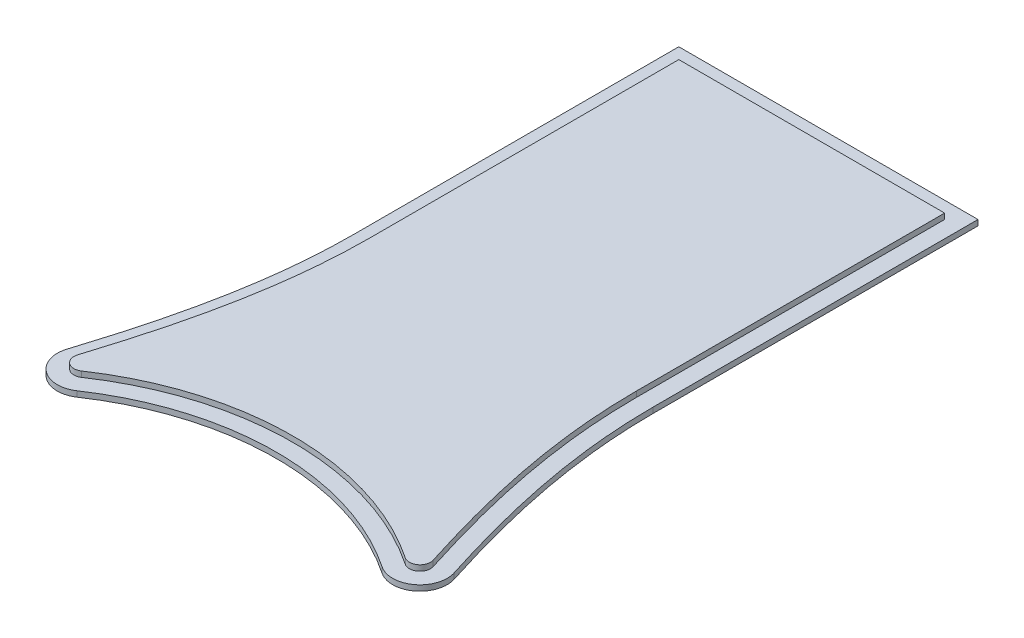
ISO-10303-21;
HEADER;
FILE_DESCRIPTION(('STEP AP214'),'2;1');
FILE_NAME('part.step','',(''),(''),'','','');
FILE_SCHEMA(('AUTOMOTIVE_DESIGN { 1 0 10303 214 1 1 1 1 }'));
ENDSEC;
DATA;
#1=APPLICATION_CONTEXT('core data for automotive mechanical design processes');
#2=APPLICATION_PROTOCOL_DEFINITION('international standard','automotive_design',2000,#1);
#3=PRODUCT_CONTEXT('',#1,'mechanical');
#4=PRODUCT('Part','Part','',(#3));
#5=PRODUCT_RELATED_PRODUCT_CATEGORY('part','',(#4));
#6=PRODUCT_DEFINITION_FORMATION('','',#4);
#7=PRODUCT_DEFINITION_CONTEXT('part definition',#1,'design');
#8=PRODUCT_DEFINITION('design','',#6,#7);
#9=PRODUCT_DEFINITION_SHAPE('','',#8);
#10=(LENGTH_UNIT() NAMED_UNIT(*) SI_UNIT(.MILLI.,.METRE.));
#11=(NAMED_UNIT(*) PLANE_ANGLE_UNIT() SI_UNIT($,.RADIAN.));
#12=(NAMED_UNIT(*) SI_UNIT($,.STERADIAN.) SOLID_ANGLE_UNIT());
#13=UNCERTAINTY_MEASURE_WITH_UNIT(LENGTH_MEASURE(1.E-05),#10,'distance_accuracy_value','');
#14=(GEOMETRIC_REPRESENTATION_CONTEXT(3) GLOBAL_UNCERTAINTY_ASSIGNED_CONTEXT((#13)) GLOBAL_UNIT_ASSIGNED_CONTEXT((#10,
#11,#12)) REPRESENTATION_CONTEXT('',''));
#15=CARTESIAN_POINT('',(0.,0.,0.));
#16=DIRECTION('',(0.,0.,1.));
#17=DIRECTION('',(1.,0.,0.));
#18=AXIS2_PLACEMENT_3D('',#15,#16,#17);
#19=CARTESIAN_POINT('',(61.9771372681462,31.9999999999998,94.6624323351156));
#20=CARTESIAN_POINT('',(60.831885322124,31.9999999999999,91.0366847148333));
#21=CARTESIAN_POINT('',(59.7481486211368,31.9999999999999,87.3929251928582));
#22=CARTESIAN_POINT('',(57.7914261350918,31.9999999999999,80.0436974655204));
#23=CARTESIAN_POINT('',(56.920574580327,31.9999999999999,76.3440377184742));
#24=CARTESIAN_POINT('',(55.4718547297966,31.9999999999999,68.8774072314943));
#25=CARTESIAN_POINT('',(54.8967894478861,31.9999999999999,65.1275738366784));
#26=CARTESIAN_POINT('',(54.1103787804902,31.9999999999999,57.5927727270901));
#27=CARTESIAN_POINT('',(53.8999996958762,31.9999999999998,53.8069725360299));
#28=CARTESIAN_POINT('',(53.8999999999995,31.9999999999998,49.9999997603436));
#29=B_SPLINE_CURVE_WITH_KNOTS('',3,(#19,#20,#21,#22,#23,#24,#25,#26,#27,#28),.UNSPECIFIED.,.F.,
.F.,(4,2,2,2,4),(0.,0.25,0.5,0.75,1.),.UNSPECIFIED.);
#30=DIRECTION('',(0.,-1.,0.));
#31=VECTOR('',#30,1.);
#32=SURFACE_OF_LINEAR_EXTRUSION('',#29,#31);
#33=CARTESIAN_POINT('',(61.9771372681461,30.9999999999998,94.6624323351156));
#34=CARTESIAN_POINT('',(60.8318853221239,30.9999999999999,91.0366847148333));
#35=CARTESIAN_POINT('',(59.7481486211367,30.9999999999999,87.3929251928582));
#36=CARTESIAN_POINT('',(57.7914261350917,30.9999999999999,80.0436974655204));
#37=CARTESIAN_POINT('',(56.9205745803269,30.9999999999999,76.3440377184742));
#38=CARTESIAN_POINT('',(55.4718547297965,30.9999999999999,68.8774072314943));
#39=CARTESIAN_POINT('',(54.8967894478861,30.9999999999999,65.1275738366784));
#40=CARTESIAN_POINT('',(54.1103787804901,30.9999999999999,57.5927727270901));
#41=CARTESIAN_POINT('',(53.8999996958761,30.9999999999998,53.8069725360299));
#42=CARTESIAN_POINT('',(53.8999999999995,30.9999999999998,49.9999997603436));
#43=B_SPLINE_CURVE_WITH_KNOTS('',3,(#33,#34,#35,#36,#37,#38,#39,#40,#41,#42),.UNSPECIFIED.,.F.,
.F.,(4,2,2,2,4),(0.,0.25,0.5,0.75,1.),.UNSPECIFIED.);
#44=CARTESIAN_POINT('',(61.9771372681508,30.9999999999998,94.6624323351142));
#45=VERTEX_POINT('',#44);
#46=CARTESIAN_POINT('',(53.8999999999995,30.9999999999998,49.9999997603436));
#47=VERTEX_POINT('',#46);
#48=EDGE_CURVE('E220',#45,#47,#43,.T.);
#49=ORIENTED_EDGE('',*,*,#48,.T.);
#50=DIRECTION('',(0.,-1.,0.));
#51=VECTOR('',#50,1.);
#52=CARTESIAN_POINT('',(53.8999999999995,31.9999999999998,49.9999997603436));
#53=LINE('',#52,#51);
#54=CARTESIAN_POINT('',(53.8999999999995,31.9999999999998,49.9999997603436));
#55=VERTEX_POINT('',#54);
#56=EDGE_CURVE('E12',#55,#47,#53,.T.);
#57=ORIENTED_EDGE('',*,*,#56,.F.);
#58=CARTESIAN_POINT('',(53.8999999999995,31.9999999999998,49.9999997603436));
#59=CARTESIAN_POINT('',(53.8999996958762,31.9999999999998,53.8069725360299));
#60=CARTESIAN_POINT('',(54.1103787804902,31.9999999999999,57.5927727270901));
#61=CARTESIAN_POINT('',(54.8967894478861,31.9999999999999,65.1275738366784));
#62=CARTESIAN_POINT('',(55.4718547297966,31.9999999999999,68.8774072314943));
#63=CARTESIAN_POINT('',(56.920574580327,31.9999999999999,76.3440377184742));
#64=CARTESIAN_POINT('',(57.7914261350918,31.9999999999999,80.0436974655204));
#65=CARTESIAN_POINT('',(59.7481486211368,31.9999999999999,87.3929251928582));
#66=CARTESIAN_POINT('',(60.831885322124,31.9999999999999,91.0366847148333));
#67=CARTESIAN_POINT('',(61.9771372681462,31.9999999999998,94.6624323351156));
#68=B_SPLINE_CURVE_WITH_KNOTS('',3,(#58,#59,#60,#61,#62,#63,#64,#65,#66,#67),.UNSPECIFIED.,.F.,
.F.,(4,2,2,2,4),(0.,0.25,0.5,0.75,1.),.UNSPECIFIED.);
#69=CARTESIAN_POINT('',(61.9771372681509,31.9999999999998,94.6624323351142));
#70=VERTEX_POINT('',#69);
#71=EDGE_CURVE('E197',#70,#55,#68,.F.);
#72=ORIENTED_EDGE('',*,*,#71,.F.);
#73=DIRECTION('',(0.,-1.,0.));
#74=VECTOR('',#73,1.);
#75=CARTESIAN_POINT('',(61.9771372681509,31.9999999999998,94.6624323351142));
#76=LINE('',#75,#74);
#77=EDGE_CURVE('E144',#70,#45,#76,.T.);
#78=ORIENTED_EDGE('',*,*,#77,.T.);
#79=EDGE_LOOP('',(#49,#57,#72,#78));
#80=FACE_BOUND('',#79,.T.);
#81=ADVANCED_FACE('F47',(#80),#32,.F.);
#82=CARTESIAN_POINT('',(53.8999999999995,31.9999999999998,49.9999997603436));
#83=DIRECTION('',(-1.,0.,0.));
#84=DIRECTION('',(0.,-1.,0.));
#85=AXIS2_PLACEMENT_3D('',#82,#83,#84);
#86=PLANE('',#85);
#87=DIRECTION('',(0.,0.,-1.));
#88=VECTOR('',#87,1.);
#89=CARTESIAN_POINT('',(53.8999999999995,30.9999999999998,49.9999997603436));
#90=LINE('',#89,#88);
#91=CARTESIAN_POINT('',(53.8999999999991,30.9999999999992,-5.39999999999987));
#92=VERTEX_POINT('',#91);
#93=EDGE_CURVE('E155',#47,#92,#90,.T.);
#94=ORIENTED_EDGE('',*,*,#93,.T.);
#95=DIRECTION('',(0.,-1.,0.));
#96=VECTOR('',#95,1.);
#97=CARTESIAN_POINT('',(53.8999999999992,31.9999999999992,-5.39999999999988));
#98=LINE('',#97,#96);
#99=CARTESIAN_POINT('',(53.8999999999992,31.9999999999992,-5.39999999999988));
#100=VERTEX_POINT('',#99);
#101=EDGE_CURVE('E58',#100,#92,#98,.T.);
#102=ORIENTED_EDGE('',*,*,#101,.F.);
#103=DIRECTION('',(0.,0.,-1.));
#104=VECTOR('',#103,1.);
#105=CARTESIAN_POINT('',(53.8999999999995,31.9999999999998,49.9999997603436));
#106=LINE('',#105,#104);
#107=EDGE_CURVE('E110',#55,#100,#106,.T.);
#108=ORIENTED_EDGE('',*,*,#107,.F.);
#109=ORIENTED_EDGE('',*,*,#56,.T.);
#110=EDGE_LOOP('',(#94,#102,#108,#109));
#111=FACE_BOUND('',#110,.T.);
#112=ADVANCED_FACE('F241',(#111),#86,.F.);
#113=CARTESIAN_POINT('',(53.8999999999992,31.9999999999992,-5.39999999999988));
#114=DIRECTION('',(0.,0.,1.));
#115=DIRECTION('',(0.,-1.,0.));
#116=AXIS2_PLACEMENT_3D('',#113,#114,#115);
#117=PLANE('',#116);
#118=DIRECTION('',(-1.,0.,0.));
#119=VECTOR('',#118,1.);
#120=CARTESIAN_POINT('',(53.8999999999991,30.9999999999992,-5.39999999999987));
#121=LINE('',#120,#119);
#122=CARTESIAN_POINT('',(6.09999999999989,31.0000000000019,-5.39999999999992));
#123=VERTEX_POINT('',#122);
#124=EDGE_CURVE('E152',#92,#123,#121,.T.);
#125=ORIENTED_EDGE('',*,*,#124,.T.);
#126=DIRECTION('',(0.,-1.,0.));
#127=VECTOR('',#126,1.);
#128=CARTESIAN_POINT('',(6.09999999999995,32.0000000000019,-5.39999999999993));
#129=LINE('',#128,#127);
#130=CARTESIAN_POINT('',(6.09999999999995,32.0000000000019,-5.39999999999993));
#131=VERTEX_POINT('',#130);
#132=EDGE_CURVE('E158',#131,#123,#129,.T.);
#133=ORIENTED_EDGE('',*,*,#132,.F.);
#134=DIRECTION('',(-1.,0.,0.));
#135=VECTOR('',#134,1.);
#136=CARTESIAN_POINT('',(53.8999999999992,31.9999999999992,-5.39999999999988));
#137=LINE('',#136,#135);
#138=EDGE_CURVE('E212',#100,#131,#137,.T.);
#139=ORIENTED_EDGE('',*,*,#138,.F.);
#140=ORIENTED_EDGE('',*,*,#101,.T.);
#141=EDGE_LOOP('',(#125,#133,#139,#140));
#142=FACE_BOUND('',#141,.T.);
#143=ADVANCED_FACE('F245',(#142),#117,.F.);
#144=CARTESIAN_POINT('',(6.09999999999995,32.0000000000019,-5.39999999999993));
#145=DIRECTION('',(1.,0.,0.));
#146=DIRECTION('',(0.,1.,0.));
#147=AXIS2_PLACEMENT_3D('',#144,#145,#146);
#148=PLANE('',#147);
#149=DIRECTION('',(0.,0.,1.));
#150=VECTOR('',#149,1.);
#151=CARTESIAN_POINT('',(6.09999999999989,31.0000000000019,-5.39999999999992));
#152=LINE('',#151,#150);
#153=CARTESIAN_POINT('',(6.09999999999932,31.0000000000024,50.0000000000008));
#154=VERTEX_POINT('',#153);
#155=EDGE_CURVE('E154',#123,#154,#152,.T.);
#156=ORIENTED_EDGE('',*,*,#155,.T.);
#157=DIRECTION('',(0.,-1.,0.));
#158=VECTOR('',#157,1.);
#159=CARTESIAN_POINT('',(6.09999999999938,32.0000000000024,50.0000000000008));
#160=LINE('',#159,#158);
#161=CARTESIAN_POINT('',(6.09999999999938,32.0000000000024,50.0000000000008));
#162=VERTEX_POINT('',#161);
#163=EDGE_CURVE('E161',#162,#154,#160,.T.);
#164=ORIENTED_EDGE('',*,*,#163,.F.);
#165=DIRECTION('',(0.,0.,1.));
#166=VECTOR('',#165,1.);
#167=CARTESIAN_POINT('',(6.09999999999995,32.0000000000019,-5.39999999999993));
#168=LINE('',#167,#166);
#169=EDGE_CURVE('E291',#131,#162,#168,.T.);
#170=ORIENTED_EDGE('',*,*,#169,.F.);
#171=ORIENTED_EDGE('',*,*,#132,.T.);
#172=EDGE_LOOP('',(#156,#164,#170,#171));
#173=FACE_BOUND('',#172,.T.);
#174=ADVANCED_FACE('F283',(#173),#148,.F.);
#175=CARTESIAN_POINT('',(6.09999999999938,32.0000000000024,50.0000000000008));
#176=CARTESIAN_POINT('',(6.09998811427953,32.0000000000025,53.8013145816372));
#177=CARTESIAN_POINT('',(5.89011158454859,32.0000000000025,57.5912409423099));
#178=CARTESIAN_POINT('',(5.10035899233924,32.0000000000027,65.1510157870064));
#179=CARTESIAN_POINT('',(4.52347776206502,32.0000000000027,68.9045065221967));
#180=CARTESIAN_POINT('',(3.07466457113571,32.0000000000029,76.3647454674164));
#181=CARTESIAN_POINT('',(2.20346017340169,32.000000000003,80.05879522566));
#182=CARTESIAN_POINT('',(0.251705761796023,32.0000000000032,87.3891606749191));
#183=CARTESIAN_POINT('',(-0.829056481060709,32.0000000000033,91.0266930358465));
#184=CARTESIAN_POINT('',(-1.97262684950157,32.0000000000034,94.6476675772352));
#185=B_SPLINE_CURVE_WITH_KNOTS('',3,(#175,#176,#177,#178,#179,#180,#181,#182,#183,#184),
.UNSPECIFIED.,.F.,.F.,(4,2,2,2,4),(0.,0.25,0.5,0.75,1.),.UNSPECIFIED.);
#186=DIRECTION('',(0.,-1.,0.));
#187=VECTOR('',#186,1.);
#188=SURFACE_OF_LINEAR_EXTRUSION('',#185,#187);
#189=CARTESIAN_POINT('',(6.09999999999932,31.0000000000024,50.0000000000008));
#190=CARTESIAN_POINT('',(6.09998811427947,31.0000000000025,53.8013145816372));
#191=CARTESIAN_POINT('',(5.89011158454854,31.0000000000025,57.5912409423099));
#192=CARTESIAN_POINT('',(5.10035899233919,31.0000000000027,65.1510157870064));
#193=CARTESIAN_POINT('',(4.52347776206497,31.0000000000027,68.9045065221967));
#194=CARTESIAN_POINT('',(3.07466457113566,31.0000000000029,76.3647454674164));
#195=CARTESIAN_POINT('',(2.20346017340163,31.000000000003,80.05879522566));
#196=CARTESIAN_POINT('',(0.251705761795968,31.0000000000032,87.3891606749192));
#197=CARTESIAN_POINT('',(-0.829056481060764,31.0000000000033,91.0266930358465));
#198=CARTESIAN_POINT('',(-1.97262684950162,31.0000000000034,94.6476675772352));
#199=B_SPLINE_CURVE_WITH_KNOTS('',3,(#189,#190,#191,#192,#193,#194,#195,#196,#197,#198),
.UNSPECIFIED.,.F.,.F.,(4,2,2,2,4),(0.,0.25,0.5,0.75,1.),.UNSPECIFIED.);
#200=CARTESIAN_POINT('',(-1.97262684950161,31.0000000000034,94.6476675772352));
#201=VERTEX_POINT('',#200);
#202=EDGE_CURVE('E249',#154,#201,#199,.T.);
#203=ORIENTED_EDGE('',*,*,#202,.T.);
#204=DIRECTION('',(0.,-1.,0.));
#205=VECTOR('',#204,1.);
#206=CARTESIAN_POINT('',(-1.97262684950156,32.0000000000034,94.6476675772351));
#207=LINE('',#206,#205);
#208=CARTESIAN_POINT('',(-1.97262684950156,32.0000000000034,94.6476675772351));
#209=VERTEX_POINT('',#208);
#210=EDGE_CURVE('E139',#209,#201,#207,.T.);
#211=ORIENTED_EDGE('',*,*,#210,.F.);
#212=CARTESIAN_POINT('',(-1.97262684950157,32.0000000000034,94.6476675772352));
#213=CARTESIAN_POINT('',(-0.829056481060709,32.0000000000033,91.0266930358465));
#214=CARTESIAN_POINT('',(0.251705761796023,32.0000000000032,87.3891606749191));
#215=CARTESIAN_POINT('',(2.20346017340169,32.000000000003,80.05879522566));
#216=CARTESIAN_POINT('',(3.07466457113571,32.0000000000029,76.3647454674164));
#217=CARTESIAN_POINT('',(4.52347776206502,32.0000000000027,68.9045065221967));
#218=CARTESIAN_POINT('',(5.10035899233924,32.0000000000027,65.1510157870064));
#219=CARTESIAN_POINT('',(5.89011158454859,32.0000000000025,57.5912409423099));
#220=CARTESIAN_POINT('',(6.09998811427953,32.0000000000025,53.8013145816372));
#221=CARTESIAN_POINT('',(6.09999999999938,32.0000000000024,50.0000000000008));
#222=B_SPLINE_CURVE_WITH_KNOTS('',3,(#212,#213,#214,#215,#216,#217,#218,#219,#220,#221),
.UNSPECIFIED.,.F.,.F.,(4,2,2,2,4),(0.,0.25,0.5,0.75,1.),.UNSPECIFIED.);
#223=EDGE_CURVE('E129',#162,#209,#222,.F.);
#224=ORIENTED_EDGE('',*,*,#223,.F.);
#225=ORIENTED_EDGE('',*,*,#163,.T.);
#226=EDGE_LOOP('',(#203,#211,#224,#225));
#227=FACE_BOUND('',#226,.T.);
#228=ADVANCED_FACE('F273',(#227),#188,.F.);
#229=CARTESIAN_POINT('',(-0.156158946894158,32.0000000000033,95.2048429165988));
#230=DIRECTION('',(0.,-1.,0.));
#231=DIRECTION('',(1.,0.,0.));
#232=AXIS2_PLACEMENT_3D('',#229,#230,#231);
#233=CYLINDRICAL_SURFACE('',#232,1.89999999999945);
#234=CARTESIAN_POINT('',(-0.156158946894213,31.0000000000033,95.2048429165988));
#235=DIRECTION('',(0.,1.,0.));
#236=DIRECTION('',(-1.,0.,0.));
#237=AXIS2_PLACEMENT_3D('',#234,#235,#236);
#238=CIRCLE('',#237,1.89999999999945);
#239=CARTESIAN_POINT('',(0.904891086385751,31.0000000000032,96.7809688084217));
#240=VERTEX_POINT('',#239);
#241=EDGE_CURVE('E138',#201,#240,#238,.T.);
#242=ORIENTED_EDGE('',*,*,#241,.T.);
#243=DIRECTION('',(0.,-1.,0.));
#244=VECTOR('',#243,1.);
#245=CARTESIAN_POINT('',(0.904891086385806,32.0000000000032,96.7809688084217));
#246=LINE('',#245,#244);
#247=CARTESIAN_POINT('',(0.904891086385806,32.0000000000032,96.7809688084217));
#248=VERTEX_POINT('',#247);
#249=EDGE_CURVE('E135',#248,#240,#246,.T.);
#250=ORIENTED_EDGE('',*,*,#249,.F.);
#251=CARTESIAN_POINT('',(-0.156158946894158,32.0000000000033,95.2048429165988));
#252=DIRECTION('',(0.,1.,0.));
#253=DIRECTION('',(-1.,0.,0.));
#254=AXIS2_PLACEMENT_3D('',#251,#252,#253);
#255=CIRCLE('',#254,1.89999999999945);
#256=EDGE_CURVE('E123',#209,#248,#255,.T.);
#257=ORIENTED_EDGE('',*,*,#256,.F.);
#258=ORIENTED_EDGE('',*,*,#210,.T.);
#259=EDGE_LOOP('',(#242,#250,#257,#258));
#260=FACE_BOUND('',#259,.T.);
#261=ADVANCED_FACE('F136',(#260),#233,.T.);
#262=CARTESIAN_POINT('',(29.9999999999996,32.0000000000021,140.000000000003));
#263=DIRECTION('',(0.,-1.,0.));
#264=DIRECTION('',(1.,0.,0.));
#265=AXIS2_PLACEMENT_3D('',#262,#263,#264);
#266=CYLINDRICAL_SURFACE('',#265,52.1000001903449);
#267=CARTESIAN_POINT('',(29.9999999999996,31.0000000000021,140.000000000003));
#268=DIRECTION('',(0.,-1.,0.));
#269=DIRECTION('',(-1.,0.,0.));
#270=AXIS2_PLACEMENT_3D('',#267,#268,#269);
#271=CIRCLE('',#270,52.1000001903449);
#272=CARTESIAN_POINT('',(59.0951103761227,31.,96.780969792979));
#273=VERTEX_POINT('',#272);
#274=EDGE_CURVE('E96',#240,#273,#271,.T.);
#275=ORIENTED_EDGE('',*,*,#274,.T.);
#276=DIRECTION('',(0.,-1.,0.));
#277=VECTOR('',#276,1.);
#278=CARTESIAN_POINT('',(59.0951103761228,32.,96.780969792979));
#279=LINE('',#278,#277);
#280=CARTESIAN_POINT('',(59.0951103761228,32.,96.780969792979));
#281=VERTEX_POINT('',#280);
#282=EDGE_CURVE('E140',#281,#273,#279,.T.);
#283=ORIENTED_EDGE('',*,*,#282,.F.);
#284=CARTESIAN_POINT('',(29.9999999999996,32.0000000000021,140.000000000003));
#285=DIRECTION('',(0.,-1.,0.));
#286=DIRECTION('',(-1.,0.,0.));
#287=AXIS2_PLACEMENT_3D('',#284,#285,#286);
#288=CIRCLE('',#287,52.1000001903449);
#289=EDGE_CURVE('E127',#248,#281,#288,.T.);
#290=ORIENTED_EDGE('',*,*,#289,.F.);
#291=ORIENTED_EDGE('',*,*,#249,.T.);
#292=EDGE_LOOP('',(#275,#283,#290,#291));
#293=FACE_BOUND('',#292,.T.);
#294=ADVANCED_FACE('F142',(#293),#266,.F.);
#295=CARTESIAN_POINT('',(60.1561792144309,31.9999999999999,95.2048300628639));
#296=DIRECTION('',(0.,-1.,0.));
#297=DIRECTION('',(1.,0.,0.));
#298=AXIS2_PLACEMENT_3D('',#295,#296,#297);
#299=CYLINDRICAL_SURFACE('',#298,1.90002198105069);
#300=CARTESIAN_POINT('',(60.1561792144308,30.9999999999999,95.2048300628639));
#301=DIRECTION('',(0.,1.,0.));
#302=DIRECTION('',(-1.,0.,0.));
#303=AXIS2_PLACEMENT_3D('',#300,#301,#302);
#304=CIRCLE('',#303,1.90002198105069);
#305=EDGE_CURVE('E102',#273,#45,#304,.T.);
#306=ORIENTED_EDGE('',*,*,#305,.T.);
#307=ORIENTED_EDGE('',*,*,#77,.F.);
#308=CARTESIAN_POINT('',(60.1561792144309,31.9999999999999,95.2048300628639));
#309=DIRECTION('',(0.,1.,0.));
#310=DIRECTION('',(-1.,0.,0.));
#311=AXIS2_PLACEMENT_3D('',#308,#309,#310);
#312=CIRCLE('',#311,1.90002198105069);
#313=EDGE_CURVE('E67',#281,#70,#312,.T.);
#314=ORIENTED_EDGE('',*,*,#313,.F.);
#315=ORIENTED_EDGE('',*,*,#282,.T.);
#316=EDGE_LOOP('',(#306,#307,#314,#315));
#317=FACE_BOUND('',#316,.T.);
#318=ADVANCED_FACE('F178',(#317),#299,.T.);
#319=CARTESIAN_POINT('',(56.1962146550618,31.9999999999999,72.6107224749843));
#320=DIRECTION('',(0.,1.,0.));
#321=DIRECTION('',(0.,0.,1.));
#322=AXIS2_PLACEMENT_3D('',#319,#320,#321);
#323=PLANE('',#322);
#324=ORIENTED_EDGE('',*,*,#71,.T.);
#325=ORIENTED_EDGE('',*,*,#107,.T.);
#326=ORIENTED_EDGE('',*,*,#138,.T.);
#327=ORIENTED_EDGE('',*,*,#169,.T.);
#328=ORIENTED_EDGE('',*,*,#223,.T.);
#329=ORIENTED_EDGE('',*,*,#256,.T.);
#330=ORIENTED_EDGE('',*,*,#289,.T.);
#331=ORIENTED_EDGE('',*,*,#313,.T.);
#332=EDGE_LOOP('',(#324,#325,#326,#327,#328,#329,#330,#331));
#333=FACE_BOUND('',#332,.T.);
#334=ADVANCED_FACE('F125',(#333),#323,.T.);
#335=CARTESIAN_POINT('',(56.1962146550617,30.9999999999999,72.6107224749843));
#336=DIRECTION('',(0.,1.,0.));
#337=DIRECTION('',(0.,0.,1.));
#338=AXIS2_PLACEMENT_3D('',#335,#336,#337);
#339=PLANE('',#338);
#340=ORIENTED_EDGE('',*,*,#48,.F.);
#341=ORIENTED_EDGE('',*,*,#305,.F.);
#342=ORIENTED_EDGE('',*,*,#274,.F.);
#343=ORIENTED_EDGE('',*,*,#241,.F.);
#344=ORIENTED_EDGE('',*,*,#202,.F.);
#345=ORIENTED_EDGE('',*,*,#155,.F.);
#346=ORIENTED_EDGE('',*,*,#124,.F.);
#347=ORIENTED_EDGE('',*,*,#93,.F.);
#348=EDGE_LOOP('',(#340,#341,#342,#343,#344,#345,#346,#347));
#349=FACE_BOUND('',#348,.T.);
#350=ADVANCED_FACE('F177',(#349),#339,.F.);
#351=CLOSED_SHELL('',(#81,#112,#143,#174,#228,#261,#294,#318,#334,#350));
#352=MANIFOLD_SOLID_BREP('B2',#351);
#353=CARTESIAN_POINT('',(64.8435120037774,30.9999999999996,93.7768501131982));
#354=CARTESIAN_POINT('',(63.7206320543695,30.9999999999997,90.2226257238345));
#355=CARTESIAN_POINT('',(62.6572562644365,30.9999999999997,86.6509505777958));
#356=CARTESIAN_POINT('',(60.7351396973803,30.9999999999997,79.4475870724027));
#357=CARTESIAN_POINT('',(59.8785533415817,30.9999999999997,75.8215608178004));
#358=CARTESIAN_POINT('',(58.4518938892415,30.9999999999998,68.5031505998741));
#359=CARTESIAN_POINT('',(57.884751670229,30.9999999999998,64.8283861320974));
#360=CARTESIAN_POINT('',(57.1082288820461,30.9999999999998,57.4431158329596));
#361=CARTESIAN_POINT('',(56.8999997018529,30.9999999999998,53.7321555537256));
#362=CARTESIAN_POINT('',(56.8999999999994,30.9999999999998,50.0000000000012));
#363=B_SPLINE_CURVE_WITH_KNOTS('',3,(#353,#354,#355,#356,#357,#358,#359,#360,#361,#362),
.UNSPECIFIED.,.F.,.F.,(4,2,2,2,4),(0.,0.25,0.5,0.75,1.),.UNSPECIFIED.);
#364=DIRECTION('',(0.,-1.,0.));
#365=VECTOR('',#364,1.);
#366=SURFACE_OF_LINEAR_EXTRUSION('',#363,#365);
#367=CARTESIAN_POINT('',(64.8435120037774,29.9999999999996,93.7768501131982));
#368=CARTESIAN_POINT('',(63.7206320543695,29.9999999999997,90.2226257238345));
#369=CARTESIAN_POINT('',(62.6572562644365,29.9999999999997,86.6509505777958));
#370=CARTESIAN_POINT('',(60.7351396973803,29.9999999999997,79.4475870724027));
#371=CARTESIAN_POINT('',(59.8785533415817,29.9999999999997,75.8215608178004));
#372=CARTESIAN_POINT('',(58.4518938892415,29.9999999999998,68.5031505998741));
#373=CARTESIAN_POINT('',(57.884751670229,29.9999999999998,64.8283861320974));
#374=CARTESIAN_POINT('',(57.1082288820461,29.9999999999998,57.4431158329596));
#375=CARTESIAN_POINT('',(56.8999997018529,29.9999999999998,53.7321555537256));
#376=CARTESIAN_POINT('',(56.8999999999994,29.9999999999998,50.0000000000012));
#377=B_SPLINE_CURVE_WITH_KNOTS('',3,(#367,#368,#369,#370,#371,#372,#373,#374,#375,#376),
.UNSPECIFIED.,.F.,.F.,(4,2,2,2,4),(0.,0.25,0.5,0.75,1.),.UNSPECIFIED.);
#378=CARTESIAN_POINT('',(64.8435120037774,29.9999999999996,93.7768501131982));
#379=VERTEX_POINT('',#378);
#380=CARTESIAN_POINT('',(56.8999999999994,29.9999999999998,50.0000000000012));
#381=VERTEX_POINT('',#380);
#382=EDGE_CURVE('E654',#379,#381,#377,.T.);
#383=ORIENTED_EDGE('',*,*,#382,.T.);
#384=DIRECTION('',(0.,-1.,0.));
#385=VECTOR('',#384,1.);
#386=CARTESIAN_POINT('',(56.8999999999994,30.9999999999998,50.0000000000012));
#387=LINE('',#386,#385);
#388=CARTESIAN_POINT('',(56.8999999999994,30.9999999999998,50.0000000000012));
#389=VERTEX_POINT('',#388);
#390=EDGE_CURVE('E45',#389,#381,#387,.T.);
#391=ORIENTED_EDGE('',*,*,#390,.F.);
#392=CARTESIAN_POINT('',(56.8999999999994,30.9999999999998,50.0000000000012));
#393=CARTESIAN_POINT('',(56.8999997018529,30.9999999999998,53.7321555537256));
#394=CARTESIAN_POINT('',(57.1082288820461,30.9999999999998,57.4431158329596));
#395=CARTESIAN_POINT('',(57.884751670229,30.9999999999998,64.8283861320974));
#396=CARTESIAN_POINT('',(58.4518938892415,30.9999999999998,68.5031505998741));
#397=CARTESIAN_POINT('',(59.8785533415817,30.9999999999997,75.8215608178004));
#398=CARTESIAN_POINT('',(60.7351396973803,30.9999999999997,79.4475870724027));
#399=CARTESIAN_POINT('',(62.6572562644365,30.9999999999997,86.6509505777958));
#400=CARTESIAN_POINT('',(63.7206320543695,30.9999999999997,90.2226257238345));
#401=CARTESIAN_POINT('',(64.8435120037774,30.9999999999996,93.7768501131982));
#402=B_SPLINE_CURVE_WITH_KNOTS('',3,(#392,#393,#394,#395,#396,#397,#398,#399,#400,#401),
.UNSPECIFIED.,.F.,.F.,(4,2,2,2,4),(0.,0.25,0.5,0.75,1.),.UNSPECIFIED.);
#403=CARTESIAN_POINT('',(64.8435120037774,30.9999999999996,93.7768501131982));
#404=VERTEX_POINT('',#403);
#405=EDGE_CURVE('E626',#404,#389,#402,.F.);
#406=ORIENTED_EDGE('',*,*,#405,.F.);
#407=DIRECTION('',(0.,-1.,0.));
#408=VECTOR('',#407,1.);
#409=CARTESIAN_POINT('',(64.8435120037774,30.9999999999996,93.7768501131982));
#410=LINE('',#409,#408);
#411=EDGE_CURVE('E488',#404,#379,#410,.T.);
#412=ORIENTED_EDGE('',*,*,#411,.T.);
#413=EDGE_LOOP('',(#383,#391,#406,#412));
#414=FACE_BOUND('',#413,.T.);
#415=ADVANCED_FACE('F389',(#414),#366,.F.);
#416=CARTESIAN_POINT('',(56.8999999999994,30.9999999999998,50.0000000000012));
#417=DIRECTION('',(-1.,0.,0.));
#418=DIRECTION('',(0.,-1.,0.));
#419=AXIS2_PLACEMENT_3D('',#416,#417,#418);
#420=PLANE('',#419);
#421=DIRECTION('',(0.,0.,-1.));
#422=VECTOR('',#421,1.);
#423=CARTESIAN_POINT('',(56.8999999999994,29.9999999999998,50.0000000000012));
#424=LINE('',#423,#422);
#425=CARTESIAN_POINT('',(56.8999999999991,29.9999999999999,-8.39999999999987));
#426=VERTEX_POINT('',#425);
#427=EDGE_CURVE('E546',#381,#426,#424,.T.);
#428=ORIENTED_EDGE('',*,*,#427,.T.);
#429=DIRECTION('',(0.,-1.,0.));
#430=VECTOR('',#429,1.);
#431=CARTESIAN_POINT('',(56.8999999999991,30.9999999999999,-8.39999999999987));
#432=LINE('',#431,#430);
#433=CARTESIAN_POINT('',(56.8999999999991,30.9999999999999,-8.39999999999987));
#434=VERTEX_POINT('',#433);
#435=EDGE_CURVE('E400',#434,#426,#432,.T.);
#436=ORIENTED_EDGE('',*,*,#435,.F.);
#437=DIRECTION('',(0.,0.,-1.));
#438=VECTOR('',#437,1.);
#439=CARTESIAN_POINT('',(56.8999999999994,30.9999999999998,50.0000000000012));
#440=LINE('',#439,#438);
#441=EDGE_CURVE('E454',#389,#434,#440,.T.);
#442=ORIENTED_EDGE('',*,*,#441,.F.);
#443=ORIENTED_EDGE('',*,*,#390,.T.);
#444=EDGE_LOOP('',(#428,#436,#442,#443));
#445=FACE_BOUND('',#444,.T.);
#446=ADVANCED_FACE('F671',(#445),#420,.F.);
#447=CARTESIAN_POINT('',(56.8999999999991,30.9999999999999,-8.39999999999987));
#448=DIRECTION('',(0.,0.,1.));
#449=DIRECTION('',(1.,0.,0.));
#450=AXIS2_PLACEMENT_3D('',#447,#448,#449);
#451=PLANE('',#450);
#452=DIRECTION('',(-1.,0.,0.));
#453=VECTOR('',#452,1.);
#454=CARTESIAN_POINT('',(56.8999999999991,29.9999999999999,-8.39999999999987));
#455=LINE('',#454,#453);
#456=CARTESIAN_POINT('',(3.09999999999991,30.0000000000008,-8.39999999999993));
#457=VERTEX_POINT('',#456);
#458=EDGE_CURVE('E541',#426,#457,#455,.T.);
#459=ORIENTED_EDGE('',*,*,#458,.T.);
#460=DIRECTION('',(0.,-1.,0.));
#461=VECTOR('',#460,1.);
#462=CARTESIAN_POINT('',(3.09999999999992,31.0000000000008,-8.39999999999993));
#463=LINE('',#462,#461);
#464=CARTESIAN_POINT('',(3.09999999999992,31.0000000000008,-8.39999999999993));
#465=VERTEX_POINT('',#464);
#466=EDGE_CURVE('E548',#465,#457,#463,.T.);
#467=ORIENTED_EDGE('',*,*,#466,.F.);
#468=DIRECTION('',(-1.,0.,0.));
#469=VECTOR('',#468,1.);
#470=CARTESIAN_POINT('',(56.8999999999991,30.9999999999999,-8.39999999999987));
#471=LINE('',#470,#469);
#472=EDGE_CURVE('E540',#434,#465,#471,.T.);
#473=ORIENTED_EDGE('',*,*,#472,.F.);
#474=ORIENTED_EDGE('',*,*,#435,.T.);
#475=EDGE_LOOP('',(#459,#467,#473,#474));
#476=FACE_BOUND('',#475,.T.);
#477=ADVANCED_FACE('F675',(#476),#451,.F.);
#478=CARTESIAN_POINT('',(3.09999999999992,31.0000000000008,-8.39999999999993));
#479=DIRECTION('',(1.,0.,0.));
#480=DIRECTION('',(0.,1.,0.));
#481=AXIS2_PLACEMENT_3D('',#478,#479,#480);
#482=PLANE('',#481);
#483=DIRECTION('',(0.,0.,1.));
#484=VECTOR('',#483,1.);
#485=CARTESIAN_POINT('',(3.09999999999991,30.0000000000008,-8.39999999999993));
#486=LINE('',#485,#484);
#487=CARTESIAN_POINT('',(3.09999999999927,30.0000000000007,50.0000000000007));
#488=VERTEX_POINT('',#487);
#489=EDGE_CURVE('E545',#457,#488,#486,.T.);
#490=ORIENTED_EDGE('',*,*,#489,.T.);
#491=DIRECTION('',(0.,-1.,0.));
#492=VECTOR('',#491,1.);
#493=CARTESIAN_POINT('',(3.09999999999929,31.0000000000007,50.0000000000007));
#494=LINE('',#493,#492);
#495=CARTESIAN_POINT('',(3.09999999999929,31.0000000000007,50.0000000000007));
#496=VERTEX_POINT('',#495);
#497=EDGE_CURVE('E551',#496,#488,#494,.T.);
#498=ORIENTED_EDGE('',*,*,#497,.F.);
#499=DIRECTION('',(0.,0.,1.));
#500=VECTOR('',#499,1.);
#501=CARTESIAN_POINT('',(3.09999999999992,31.0000000000008,-8.39999999999993));
#502=LINE('',#501,#500);
#503=EDGE_CURVE('E580',#465,#496,#502,.T.);
#504=ORIENTED_EDGE('',*,*,#503,.F.);
#505=ORIENTED_EDGE('',*,*,#466,.T.);
#506=EDGE_LOOP('',(#490,#498,#504,#505));
#507=FACE_BOUND('',#506,.T.);
#508=ADVANCED_FACE('F530',(#507),#482,.F.);
#509=CARTESIAN_POINT('',(3.09999999999929,31.0000000000007,50.0000000000007));
#510=CARTESIAN_POINT('',(3.09999679841227,31.0000000000007,53.72685721013));
#511=CARTESIAN_POINT('',(2.89224059660364,31.0000000000007,57.4424050538926));
#512=CARTESIAN_POINT('',(2.11217408299241,31.0000000000007,64.8536556562152));
#513=CARTESIAN_POINT('',(1.54302367032464,31.0000000000007,68.5328945533186));
#514=CARTESIAN_POINT('',(-0.597610279008472,31.0000000000007,79.5024282814441));
#515=CARTESIAN_POINT('',(-2.59792193549164,31.0000000000008,86.6681283225209));
#516=CARTESIAN_POINT('',(-4.84073406414571,31.0000000000008,93.7679170413976));
#517=B_SPLINE_CURVE_WITH_KNOTS('',3,(#509,#510,#511,#512,#513,#514,#515,#516),.UNSPECIFIED.,.F.,
.F.,(4,2,2,4),(0.,0.25,0.5,1.),.UNSPECIFIED.);
#518=DIRECTION('',(0.,-1.,0.));
#519=VECTOR('',#518,1.);
#520=SURFACE_OF_LINEAR_EXTRUSION('',#517,#519);
#521=CARTESIAN_POINT('',(3.09999999999927,30.0000000000007,50.0000000000007));
#522=CARTESIAN_POINT('',(3.09999679841226,30.0000000000007,53.72685721013));
#523=CARTESIAN_POINT('',(2.89224059660362,30.0000000000007,57.4424050538926));
#524=CARTESIAN_POINT('',(2.11217408299239,30.0000000000007,64.8536556562152));
#525=CARTESIAN_POINT('',(1.54302367032462,30.0000000000007,68.5328945533186));
#526=CARTESIAN_POINT('',(-0.597610279008489,30.0000000000007,79.5024282814441));
#527=CARTESIAN_POINT('',(-2.59792193549165,30.0000000000008,86.6681283225209));
#528=CARTESIAN_POINT('',(-4.84073406414573,30.0000000000008,93.7679170413976));
#529=B_SPLINE_CURVE_WITH_KNOTS('',3,(#521,#522,#523,#524,#525,#526,#527,#528),.UNSPECIFIED.,.F.,
.F.,(4,2,2,4),(0.,0.25,0.5,1.),.UNSPECIFIED.);
#530=CARTESIAN_POINT('',(-4.84073406414573,30.0000000000008,93.7679170413976));
#531=VERTEX_POINT('',#530);
#532=EDGE_CURVE('E599',#488,#531,#529,.T.);
#533=ORIENTED_EDGE('',*,*,#532,.T.);
#534=DIRECTION('',(0.,-1.,0.));
#535=VECTOR('',#534,1.);
#536=CARTESIAN_POINT('',(-4.84073406414571,31.0000000000008,93.7679170413976));
#537=LINE('',#536,#535);
#538=CARTESIAN_POINT('',(-4.84073406414571,31.0000000000008,93.7679170413976));
#539=VERTEX_POINT('',#538);
#540=EDGE_CURVE('E483',#539,#531,#537,.T.);
#541=ORIENTED_EDGE('',*,*,#540,.F.);
#542=CARTESIAN_POINT('',(-4.84073406414571,31.0000000000008,93.7679170413976));
#543=CARTESIAN_POINT('',(-2.59792193549164,31.0000000000008,86.6681283225209));
#544=CARTESIAN_POINT('',(-0.597610279008472,31.0000000000007,79.5024282814441));
#545=CARTESIAN_POINT('',(1.54302367032464,31.0000000000007,68.5328945533186));
#546=CARTESIAN_POINT('',(2.11217408299241,31.0000000000007,64.8536556562152));
#547=CARTESIAN_POINT('',(2.89224059660364,31.0000000000007,57.4424050538926));
#548=CARTESIAN_POINT('',(3.09999679841227,31.0000000000007,53.72685721013));
#549=CARTESIAN_POINT('',(3.09999999999929,31.0000000000007,50.0000000000007));
#550=B_SPLINE_CURVE_WITH_KNOTS('',3,(#542,#543,#544,#545,#546,#547,#548,#549),.UNSPECIFIED.,.F.,
.F.,(4,2,2,4),(0.,0.5,0.75,1.),.UNSPECIFIED.);
#551=EDGE_CURVE('E473',#496,#539,#550,.F.);
#552=ORIENTED_EDGE('',*,*,#551,.F.);
#553=ORIENTED_EDGE('',*,*,#497,.T.);
#554=EDGE_LOOP('',(#533,#541,#552,#553));
#555=FACE_BOUND('',#554,.T.);
#556=ADVANCED_FACE('F525',(#555),#520,.F.);
#557=CARTESIAN_POINT('',(-0.156158946894213,31.0000000000007,95.2048429165988));
#558=DIRECTION('',(0.,-1.,0.));
#559=DIRECTION('',(1.,0.,0.));
#560=AXIS2_PLACEMENT_3D('',#557,#558,#559);
#561=CYLINDRICAL_SURFACE('',#560,4.89999999999945);
#562=CARTESIAN_POINT('',(-0.15615894689423,30.0000000000007,95.2048429165988));
#563=DIRECTION('',(0.,1.,0.));
#564=DIRECTION('',(-1.,0.,0.));
#565=AXIS2_PLACEMENT_3D('',#562,#563,#564);
#566=CIRCLE('',#565,4.89999999999945);
#567=CARTESIAN_POINT('',(2.58023324419666,30.0000000000007,99.2695886376165));
#568=VERTEX_POINT('',#567);
#569=EDGE_CURVE('E482',#531,#568,#566,.T.);
#570=ORIENTED_EDGE('',*,*,#569,.T.);
#571=DIRECTION('',(0.,-1.,0.));
#572=VECTOR('',#571,1.);
#573=CARTESIAN_POINT('',(2.58023324419668,31.0000000000007,99.2695886376165));
#574=LINE('',#573,#572);
#575=CARTESIAN_POINT('',(2.58023324419668,31.0000000000007,99.2695886376165));
#576=VERTEX_POINT('',#575);
#577=EDGE_CURVE('E479',#576,#568,#574,.T.);
#578=ORIENTED_EDGE('',*,*,#577,.F.);
#579=CARTESIAN_POINT('',(-0.156158946894213,31.0000000000007,95.2048429165988));
#580=DIRECTION('',(0.,1.,0.));
#581=DIRECTION('',(-1.,0.,0.));
#582=AXIS2_PLACEMENT_3D('',#579,#580,#581);
#583=CIRCLE('',#582,4.89999999999945);
#584=EDGE_CURVE('E467',#539,#576,#583,.T.);
#585=ORIENTED_EDGE('',*,*,#584,.F.);
#586=ORIENTED_EDGE('',*,*,#540,.T.);
#587=EDGE_LOOP('',(#570,#578,#585,#586));
#588=FACE_BOUND('',#587,.T.);
#589=ADVANCED_FACE('F480',(#588),#561,.T.);
#590=CARTESIAN_POINT('',(29.9999999999996,31.0000000000002,140.000000000003));
#591=DIRECTION('',(0.,-1.,0.));
#592=DIRECTION('',(1.,0.,0.));
#593=AXIS2_PLACEMENT_3D('',#590,#591,#592);
#594=CYLINDRICAL_SURFACE('',#593,49.1000001903449);
#595=CARTESIAN_POINT('',(29.9999999999996,30.0000000000002,140.000000000003));
#596=DIRECTION('',(0.,-1.,0.));
#597=DIRECTION('',(-1.,0.,0.));
#598=AXIS2_PLACEMENT_3D('',#595,#596,#597);
#599=CIRCLE('',#598,49.1000001903449);
#600=CARTESIAN_POINT('',(57.4197681340956,29.9999999999998,99.2695895654852));
#601=VERTEX_POINT('',#600);
#602=EDGE_CURVE('E439',#568,#601,#599,.T.);
#603=ORIENTED_EDGE('',*,*,#602,.T.);
#604=DIRECTION('',(0.,-1.,0.));
#605=VECTOR('',#604,1.);
#606=CARTESIAN_POINT('',(57.4197681340956,30.9999999999998,99.2695895654852));
#607=LINE('',#606,#605);
#608=CARTESIAN_POINT('',(57.4197681340956,30.9999999999998,99.2695895654852));
#609=VERTEX_POINT('',#608);
#610=EDGE_CURVE('E484',#609,#601,#607,.T.);
#611=ORIENTED_EDGE('',*,*,#610,.F.);
#612=CARTESIAN_POINT('',(29.9999999999996,31.0000000000002,140.000000000003));
#613=DIRECTION('',(0.,-1.,0.));
#614=DIRECTION('',(-1.,0.,0.));
#615=AXIS2_PLACEMENT_3D('',#612,#613,#614);
#616=CIRCLE('',#615,49.1000001903449);
#617=EDGE_CURVE('E471',#576,#609,#616,.T.);
#618=ORIENTED_EDGE('',*,*,#617,.F.);
#619=ORIENTED_EDGE('',*,*,#577,.T.);
#620=EDGE_LOOP('',(#603,#611,#618,#619));
#621=FACE_BOUND('',#620,.T.);
#622=ADVANCED_FACE('F486',(#621),#594,.F.);
#623=CARTESIAN_POINT('',(60.1561792144308,30.9999999999997,95.2048300628639));
#624=DIRECTION('',(0.,-1.,0.));
#625=DIRECTION('',(1.,0.,0.));
#626=AXIS2_PLACEMENT_3D('',#623,#624,#625);
#627=CYLINDRICAL_SURFACE('',#626,4.90002198104569);
#628=CARTESIAN_POINT('',(60.1561792144308,29.9999999999997,95.2048300628639));
#629=DIRECTION('',(0.,1.,0.));
#630=DIRECTION('',(-0.558448735724074,0.,0.829539034384871));
#631=AXIS2_PLACEMENT_3D('',#628,#629,#630);
#632=CIRCLE('',#631,4.90002198104569);
#633=EDGE_CURVE('E445',#601,#379,#632,.T.);
#634=ORIENTED_EDGE('',*,*,#633,.T.);
#635=ORIENTED_EDGE('',*,*,#411,.F.);
#636=CARTESIAN_POINT('',(57.4197681340957,31.0000000000001,99.2695895654852));
#637=CARTESIAN_POINT('',(58.568748026216,31.0000000000001,100.042707856739));
#638=CARTESIAN_POINT('',(59.9518507343211,31.,100.100589992328));
#639=CARTESIAN_POINT('',(60.7647097737194,31.,100.134607724242));
#640=CARTESIAN_POINT('',(61.5460115637162,30.9999999999999,99.9036151670808));
#641=CARTESIAN_POINT('',(62.3748126296327,30.9999999999999,99.6585794074745));
#642=CARTESIAN_POINT('',(63.070638092396,30.9999999999998,99.1438838659213));
#643=CARTESIAN_POINT('',(63.7654736517533,30.9999999999998,98.6299205465947));
#644=CARTESIAN_POINT('',(64.2430470256372,30.9999999999997,97.9081108304602));
#645=CARTESIAN_POINT('',(64.691968458466,30.9999999999997,97.2296059771397));
#646=CARTESIAN_POINT('',(64.8976409300993,30.9999999999997,96.4412588774671));
#647=CARTESIAN_POINT('',(65.2469693297054,30.9999999999997,95.1022754516549));
#648=CARTESIAN_POINT('',(64.8435120037774,30.9999999999997,93.7768501131982));
#649=B_SPLINE_CURVE_WITH_KNOTS('',2,(#636,#637,#638,#639,#640,#641,#642,#643,#644,#645,#646,
#647,#648),.UNSPECIFIED.,.F.,.F.,(3,2,2,2,2,2,3),(0.,0.25,0.375,0.5,0.625,0.75,1.),.UNSPECIFIED.);
#650=EDGE_CURVE('E409',#609,#404,#649,.T.);
#651=ORIENTED_EDGE('',*,*,#650,.F.);
#652=ORIENTED_EDGE('',*,*,#610,.T.);
#653=EDGE_LOOP('',(#634,#635,#651,#652));
#654=FACE_BOUND('',#653,.T.);
#655=ADVANCED_FACE('F507',(#654),#627,.T.);
#656=CARTESIAN_POINT('',(59.1652236154116,30.9999999999998,72.1623557088373));
#657=DIRECTION('',(0.,1.,0.));
#658=DIRECTION('',(-1.,0.,0.));
#659=AXIS2_PLACEMENT_3D('',#656,#657,#658);
#660=PLANE('',#659);
#661=ORIENTED_EDGE('',*,*,#405,.T.);
#662=ORIENTED_EDGE('',*,*,#441,.T.);
#663=ORIENTED_EDGE('',*,*,#472,.T.);
#664=ORIENTED_EDGE('',*,*,#503,.T.);
#665=ORIENTED_EDGE('',*,*,#551,.T.);
#666=ORIENTED_EDGE('',*,*,#584,.T.);
#667=ORIENTED_EDGE('',*,*,#617,.T.);
#668=ORIENTED_EDGE('',*,*,#650,.T.);
#669=EDGE_LOOP('',(#661,#662,#663,#664,#665,#666,#667,#668));
#670=FACE_BOUND('',#669,.T.);
#671=ADVANCED_FACE('F469',(#670),#660,.T.);
#672=CARTESIAN_POINT('',(59.1652236154116,29.9999999999997,72.1623557088373));
#673=DIRECTION('',(0.,1.,0.));
#674=DIRECTION('',(-1.,0.,0.));
#675=AXIS2_PLACEMENT_3D('',#672,#673,#674);
#676=PLANE('',#675);
#677=ORIENTED_EDGE('',*,*,#382,.F.);
#678=ORIENTED_EDGE('',*,*,#633,.F.);
#679=ORIENTED_EDGE('',*,*,#602,.F.);
#680=ORIENTED_EDGE('',*,*,#569,.F.);
#681=ORIENTED_EDGE('',*,*,#532,.F.);
#682=ORIENTED_EDGE('',*,*,#489,.F.);
#683=ORIENTED_EDGE('',*,*,#458,.F.);
#684=ORIENTED_EDGE('',*,*,#427,.F.);
#685=EDGE_LOOP('',(#677,#678,#679,#680,#681,#682,#683,#684));
#686=FACE_BOUND('',#685,.T.);
#687=ADVANCED_FACE('F517',(#686),#676,.F.);
#688=CLOSED_SHELL('',(#415,#446,#477,#508,#556,#589,#622,#655,#671,#687));
#689=MANIFOLD_SOLID_BREP('B6',#688);
#690=ADVANCED_BREP_SHAPE_REPRESENTATION('',(#18,#352,#689),#14);
#691=SHAPE_DEFINITION_REPRESENTATION(#9,#690);
ENDSEC;
END-ISO-10303-21;
